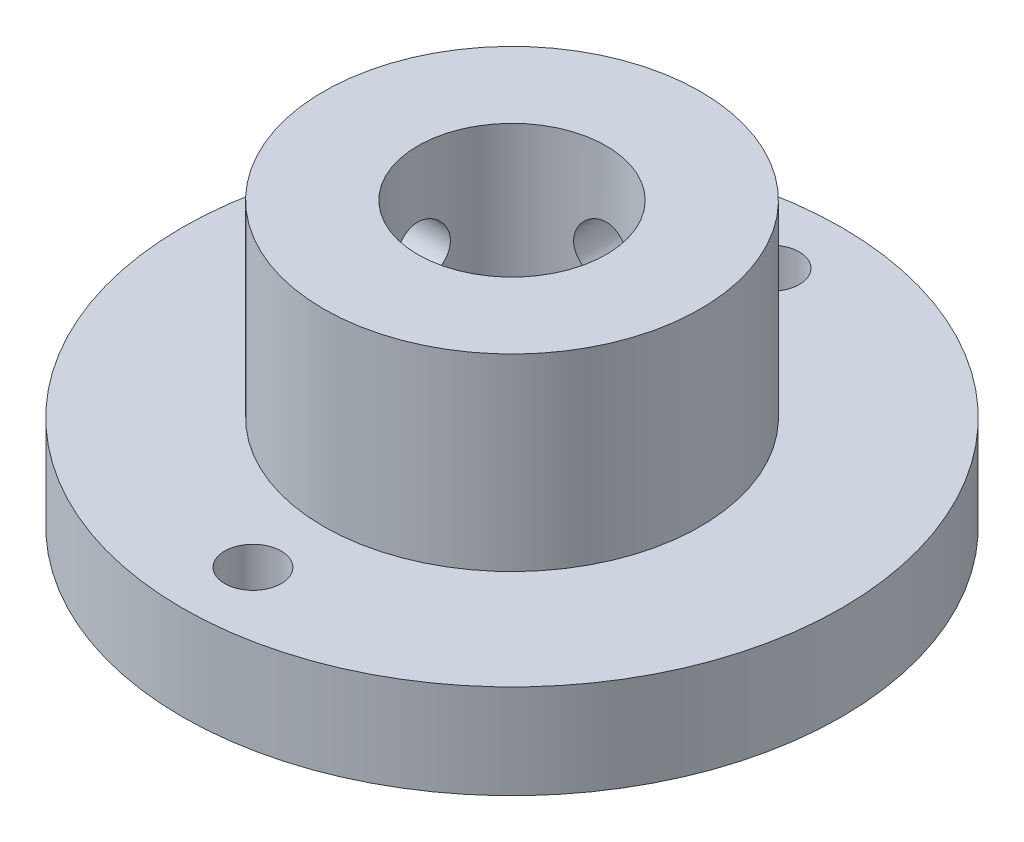
ISO-10303-21;
HEADER;
FILE_DESCRIPTION(('STEP AP214'),'2;1');
FILE_NAME('part.step','',(''),(''),'','','');
FILE_SCHEMA(('AUTOMOTIVE_DESIGN { 1 0 10303 214 1 1 1 1 }'));
ENDSEC;
DATA;
#1=APPLICATION_CONTEXT('core data for automotive mechanical design processes');
#2=APPLICATION_PROTOCOL_DEFINITION('international standard','automotive_design',2000,#1);
#3=PRODUCT_CONTEXT('',#1,'mechanical');
#4=PRODUCT('Part','Part','',(#3));
#5=PRODUCT_RELATED_PRODUCT_CATEGORY('part','',(#4));
#6=PRODUCT_DEFINITION_FORMATION('','',#4);
#7=PRODUCT_DEFINITION_CONTEXT('part definition',#1,'design');
#8=PRODUCT_DEFINITION('design','',#6,#7);
#9=PRODUCT_DEFINITION_SHAPE('','',#8);
#10=(LENGTH_UNIT() NAMED_UNIT(*) SI_UNIT(.MILLI.,.METRE.));
#11=(NAMED_UNIT(*) PLANE_ANGLE_UNIT() SI_UNIT($,.RADIAN.));
#12=(NAMED_UNIT(*) SI_UNIT($,.STERADIAN.) SOLID_ANGLE_UNIT());
#13=UNCERTAINTY_MEASURE_WITH_UNIT(LENGTH_MEASURE(1.E-05),#10,'distance_accuracy_value','');
#14=(GEOMETRIC_REPRESENTATION_CONTEXT(3) GLOBAL_UNCERTAINTY_ASSIGNED_CONTEXT((#13)) GLOBAL_UNIT_ASSIGNED_CONTEXT((#10,
#11,#12)) REPRESENTATION_CONTEXT('',''));
#15=CARTESIAN_POINT('',(0.,0.,0.));
#16=DIRECTION('',(0.,0.,1.));
#17=DIRECTION('',(1.,0.,0.));
#18=AXIS2_PLACEMENT_3D('',#15,#16,#17);
#19=CARTESIAN_POINT('',(0.,5.,0.));
#20=DIRECTION('',(0.,-1.,0.));
#21=DIRECTION('',(0.,0.,-1.));
#22=AXIS2_PLACEMENT_3D('',#19,#20,#21);
#23=CYLINDRICAL_SURFACE('',#22,17.5);
#24=CARTESIAN_POINT('',(0.,5.,0.));
#25=DIRECTION('',(0.,1.,0.));
#26=DIRECTION('',(0.,0.,1.));
#27=AXIS2_PLACEMENT_3D('',#24,#25,#26);
#28=CIRCLE('',#27,17.5);
#29=CARTESIAN_POINT('',(0.,5.,17.5));
#30=VERTEX_POINT('',#29);
#31=EDGE_CURVE('E49',#30,#30,#28,.T.);
#32=ORIENTED_EDGE('',*,*,#31,.F.);
#33=EDGE_LOOP('',(#32));
#34=FACE_BOUND('',#33,.T.);
#35=CARTESIAN_POINT('',(0.,0.,0.));
#36=DIRECTION('',(0.,1.,0.));
#37=DIRECTION('',(0.,0.,1.));
#38=AXIS2_PLACEMENT_3D('',#35,#36,#37);
#39=CIRCLE('',#38,17.5);
#40=CARTESIAN_POINT('',(0.,0.,17.5));
#41=VERTEX_POINT('',#40);
#42=EDGE_CURVE('E54',#41,#41,#39,.T.);
#43=ORIENTED_EDGE('',*,*,#42,.T.);
#44=EDGE_LOOP('',(#43));
#45=FACE_BOUND('',#44,.T.);
#46=ADVANCED_FACE('F37',(#34,#45),#23,.T.);
#47=CARTESIAN_POINT('',(0.,5.,0.));
#48=DIRECTION('',(0.,1.,0.));
#49=DIRECTION('',(0.,0.,1.));
#50=AXIS2_PLACEMENT_3D('',#47,#48,#49);
#51=PLANE('',#50);
#52=CARTESIAN_POINT('',(0.,5.,-13.75));
#53=DIRECTION('',(0.,1.,0.));
#54=DIRECTION('',(0.,0.,1.));
#55=AXIS2_PLACEMENT_3D('',#52,#53,#54);
#56=CIRCLE('',#55,1.5);
#57=CARTESIAN_POINT('',(0.,5.,-12.25));
#58=VERTEX_POINT('',#57);
#59=EDGE_CURVE('E66',#58,#58,#56,.T.);
#60=ORIENTED_EDGE('',*,*,#59,.F.);
#61=EDGE_LOOP('',(#60));
#62=FACE_BOUND('',#61,.T.);
#63=CARTESIAN_POINT('',(0.,5.,13.75));
#64=DIRECTION('',(0.,1.,0.));
#65=DIRECTION('',(0.,0.,1.));
#66=AXIS2_PLACEMENT_3D('',#63,#64,#65);
#67=CIRCLE('',#66,1.5);
#68=CARTESIAN_POINT('',(0.,5.,15.25));
#69=VERTEX_POINT('',#68);
#70=EDGE_CURVE('E98',#69,#69,#67,.T.);
#71=ORIENTED_EDGE('',*,*,#70,.F.);
#72=EDGE_LOOP('',(#71));
#73=FACE_BOUND('',#72,.T.);
#74=CARTESIAN_POINT('',(0.,5.,0.));
#75=DIRECTION('',(0.,1.,0.));
#76=DIRECTION('',(0.,0.,1.));
#77=AXIS2_PLACEMENT_3D('',#74,#75,#76);
#78=CIRCLE('',#77,10.);
#79=CARTESIAN_POINT('',(0.,5.,10.));
#80=VERTEX_POINT('',#79);
#81=EDGE_CURVE('E10',#80,#80,#78,.T.);
#82=ORIENTED_EDGE('',*,*,#81,.F.);
#83=EDGE_LOOP('',(#82));
#84=FACE_BOUND('',#83,.T.);
#85=ORIENTED_EDGE('',*,*,#31,.T.);
#86=EDGE_LOOP('',(#85));
#87=FACE_BOUND('',#86,.T.);
#88=ADVANCED_FACE('F110',(#62,#73,#84,#87),#51,.T.);
#89=CARTESIAN_POINT('',(0.,0.,0.));
#90=DIRECTION('',(0.,1.,0.));
#91=DIRECTION('',(0.,0.,1.));
#92=AXIS2_PLACEMENT_3D('',#89,#90,#91);
#93=PLANE('',#92);
#94=CARTESIAN_POINT('',(0.,0.,-13.75));
#95=DIRECTION('',(0.,1.,0.));
#96=DIRECTION('',(0.,0.,1.));
#97=AXIS2_PLACEMENT_3D('',#94,#95,#96);
#98=CIRCLE('',#97,1.5);
#99=CARTESIAN_POINT('',(0.,0.,-12.25));
#100=VERTEX_POINT('',#99);
#101=EDGE_CURVE('E65',#100,#100,#98,.T.);
#102=ORIENTED_EDGE('',*,*,#101,.T.);
#103=EDGE_LOOP('',(#102));
#104=FACE_BOUND('',#103,.T.);
#105=CARTESIAN_POINT('',(0.,0.,13.75));
#106=DIRECTION('',(0.,1.,0.));
#107=DIRECTION('',(0.,0.,1.));
#108=AXIS2_PLACEMENT_3D('',#105,#106,#107);
#109=CIRCLE('',#108,1.5);
#110=CARTESIAN_POINT('',(0.,0.,15.25));
#111=VERTEX_POINT('',#110);
#112=EDGE_CURVE('E62',#111,#111,#109,.T.);
#113=ORIENTED_EDGE('',*,*,#112,.T.);
#114=EDGE_LOOP('',(#113));
#115=FACE_BOUND('',#114,.T.);
#116=CARTESIAN_POINT('',(0.,0.,0.));
#117=DIRECTION('',(0.,1.,0.));
#118=DIRECTION('',(0.,0.,1.));
#119=AXIS2_PLACEMENT_3D('',#116,#117,#118);
#120=CIRCLE('',#119,5.);
#121=CARTESIAN_POINT('',(0.,0.,5.));
#122=VERTEX_POINT('',#121);
#123=EDGE_CURVE('E202',#122,#122,#120,.T.);
#124=ORIENTED_EDGE('',*,*,#123,.T.);
#125=EDGE_LOOP('',(#124));
#126=FACE_BOUND('',#125,.T.);
#127=ORIENTED_EDGE('',*,*,#42,.F.);
#128=EDGE_LOOP('',(#127));
#129=FACE_BOUND('',#128,.T.);
#130=ADVANCED_FACE('F108',(#104,#115,#126,#129),#93,.F.);
#131=CARTESIAN_POINT('',(0.,15.,0.));
#132=DIRECTION('',(0.,-1.,0.));
#133=DIRECTION('',(0.,0.,-1.));
#134=AXIS2_PLACEMENT_3D('',#131,#132,#133);
#135=CYLINDRICAL_SURFACE('',#134,10.);
#136=CARTESIAN_POINT('',(-10.,8.5,0.));
#137=CARTESIAN_POINT('',(-9.99999865771297,8.50000345381524,-0.083751544481642));
#138=CARTESIAN_POINT('',(-9.9989368253704,8.50703800084064,-0.167551685082131));
#139=CARTESIAN_POINT('',(-9.99480315973187,8.53498319998275,-0.332809627994913));
#140=CARTESIAN_POINT('',(-9.99172936938473,8.5559073629449,-0.414265068974229));
#141=CARTESIAN_POINT('',(-9.98391721219526,8.61099250496762,-0.57241808622186));
#142=CARTESIAN_POINT('',(-9.97918010370919,8.64514347950595,-0.649119207826798));
#143=CARTESIAN_POINT('',(-9.96856475911724,8.72568837941686,-0.795690428635253));
#144=CARTESIAN_POINT('',(-9.96268668152773,8.77208060441736,-0.865561474725188));
#145=CARTESIAN_POINT('',(-9.95039170991452,8.87617726493988,-0.997046719562125));
#146=CARTESIAN_POINT('',(-9.94397133890331,8.93395845620821,-1.0585998322255));
#147=CARTESIAN_POINT('',(-9.93134261133238,9.05902768889387,-1.17117490668948));
#148=CARTESIAN_POINT('',(-9.92513426698505,9.12631627677852,-1.22219626272936));
#149=CARTESIAN_POINT('',(-9.91359877458726,9.26890064352249,-1.31249729499943));
#150=CARTESIAN_POINT('',(-9.90827611975031,9.34423424698134,-1.35171787037205));
#151=CARTESIAN_POINT('',(-9.89916211306268,9.50051282064543,-1.41692632171056));
#152=CARTESIAN_POINT('',(-9.89537067775449,9.58145748474389,-1.44291491889163));
#153=CARTESIAN_POINT('',(-9.88978256218673,9.74601804187172,-1.48073198798911));
#154=CARTESIAN_POINT('',(-9.8879711574125,9.82960939340802,-1.49266503640518));
#155=CARTESIAN_POINT('',(-9.88650348970582,9.99762616598728,-1.50235624033932));
#156=CARTESIAN_POINT('',(-9.88684710303147,10.0820515388625,-1.50011520973796));
#157=CARTESIAN_POINT('',(-9.88963718352409,10.2486010801941,-1.48160733250788));
#158=CARTESIAN_POINT('',(-9.89206618761549,10.3307385264848,-1.4654569592775));
#159=CARTESIAN_POINT('',(-9.89872608126367,10.4911243688715,-1.41977117403734));
#160=CARTESIAN_POINT('',(-9.90295702179379,10.5693726548807,-1.39023538337812));
#161=CARTESIAN_POINT('',(-9.91276335545481,10.7201133712829,-1.31849603529736));
#162=CARTESIAN_POINT('',(-9.91834396766526,10.7925819690924,-1.27624314283198));
#163=CARTESIAN_POINT('',(-9.93021707574548,10.9294445957819,-1.18030413128955));
#164=CARTESIAN_POINT('',(-9.93650961832501,10.9938380942694,-1.12661726182478));
#165=CARTESIAN_POINT('',(-9.94917473056209,11.1133976607397,-1.00869493078248));
#166=CARTESIAN_POINT('',(-9.95554747112815,11.1684649902863,-0.944359329642002));
#167=CARTESIAN_POINT('',(-9.96759647648462,11.2670359345073,-0.807307089894187));
#168=CARTESIAN_POINT('',(-9.9732727382251,11.3105394985439,-0.734590414588171));
#169=CARTESIAN_POINT('',(-9.98329515585393,11.3847530864995,-0.582754598213687));
#170=CARTESIAN_POINT('',(-9.98764051925428,11.4154554918403,-0.503631677836781));
#171=CARTESIAN_POINT('',(-9.99450490557069,11.4631093896854,-0.341273182487062));
#172=CARTESIAN_POINT('',(-9.99702405195467,11.4800618118156,-0.258037885952602));
#173=CARTESIAN_POINT('',(-9.99993581133871,11.4996032298167,-0.0906695676436474));
#174=CARTESIAN_POINT('',(-10.0003485209039,11.5023279713793,-0.00655273187047128));
#175=CARTESIAN_POINT('',(-9.99905561015226,11.493696994689,0.160936677662282));
#176=CARTESIAN_POINT('',(-9.99735005541369,11.4823417123319,0.244309274381876));
#177=CARTESIAN_POINT('',(-9.99202468615333,11.4459858998225,0.407532387431407));
#178=CARTESIAN_POINT('',(-9.98841415207984,11.4210515039692,0.487397963079837));
#179=CARTESIAN_POINT('',(-9.97968235658369,11.3583150025382,0.641814958642998));
#180=CARTESIAN_POINT('',(-9.97456102421565,11.3205122926664,0.716366128795099));
#181=CARTESIAN_POINT('',(-9.96332682468686,11.2327937754361,0.85863497929192));
#182=CARTESIAN_POINT('',(-9.95720701626745,11.1827918599872,0.926299009891564));
#183=CARTESIAN_POINT('',(-9.94467863012165,11.0722141883713,1.0523236731777));
#184=CARTESIAN_POINT('',(-9.93827003562867,11.0116378176754,1.1106837647934));
#185=CARTESIAN_POINT('',(-9.92582264304494,10.8810264668235,1.21693784957195));
#186=CARTESIAN_POINT('',(-9.91978736017588,10.8109170748052,1.26474084747421));
#187=CARTESIAN_POINT('',(-9.90883219104903,10.6635839594882,1.34789129270584));
#188=CARTESIAN_POINT('',(-9.90391227465628,10.5863604284785,1.38323907656436));
#189=CARTESIAN_POINT('',(-9.89577033008645,10.4272624663769,1.44033467323943));
#190=CARTESIAN_POINT('',(-9.89254233006438,10.3454055390288,1.46213037141635));
#191=CARTESIAN_POINT('',(-9.88813382297802,10.1791409845649,1.49165549501586));
#192=CARTESIAN_POINT('',(-9.88695317451771,10.0947335340053,1.49938589183066));
#193=CARTESIAN_POINT('',(-9.88677832610841,9.92667093668422,1.5005378666944));
#194=CARTESIAN_POINT('',(-9.88776226333502,9.84301675824308,1.49410252167313));
#195=CARTESIAN_POINT('',(-9.89175820611174,9.67799473667649,1.46741229544379));
#196=CARTESIAN_POINT('',(-9.89477020841118,9.59662688988661,1.44715743638627));
#197=CARTESIAN_POINT('',(-9.90247526112297,9.43852691776568,1.39345373518665));
#198=CARTESIAN_POINT('',(-9.90716703716075,9.36179132956657,1.36001489324314));
#199=CARTESIAN_POINT('',(-9.91770454557702,9.2149963661976,1.28090667642309));
#200=CARTESIAN_POINT('',(-9.92355031702724,9.14493721719636,1.23523688741502));
#201=CARTESIAN_POINT('',(-9.93580743364938,9.01275694202483,1.13244337659164));
#202=CARTESIAN_POINT('',(-9.94222367881967,8.95071866675294,1.07521369039806));
#203=CARTESIAN_POINT('',(-9.95485788826636,8.83707544521218,0.951148841082835));
#204=CARTESIAN_POINT('',(-9.96107580610759,8.78547292742384,0.884311448350942));
#205=CARTESIAN_POINT('',(-9.9726518579052,8.69391232339264,0.742495707543723));
#206=CARTESIAN_POINT('',(-9.9780050712882,8.65401989078526,0.667474576764761));
#207=CARTESIAN_POINT('',(-9.98720028802959,8.58746148324196,0.51175187024872));
#208=CARTESIAN_POINT('',(-9.99104385565757,8.56078180994631,0.431056277096705));
#209=CARTESIAN_POINT('',(-9.99590939261505,8.52745865728989,0.29166572788933));
#210=CARTESIAN_POINT('',(-9.99743549179557,8.51717739846119,0.233831133495279));
#211=CARTESIAN_POINT('',(-9.99948125947896,8.50344690228736,0.117338971600125));
#212=CARTESIAN_POINT('',(-10.0000009404877,8.49999758004746,0.0586814143344171));
#213=CARTESIAN_POINT('',(-10.,8.5,0.));
#214=B_SPLINE_CURVE_WITH_KNOTS('',3,(#136,#137,#138,#139,#140,#141,#142,#143,#144,#145,#146,
#147,#148,#149,#150,#151,#152,#153,#154,#155,#156,#157,#158,#159,#160,#161,#162,#163,#164,#165,
#166,#167,#168,#169,#170,#171,#172,#173,#174,#175,#176,#177,#178,#179,#180,#181,#182,#183,#184,
#185,#186,#187,#188,#189,#190,#191,#192,#193,#194,#195,#196,#197,#198,#199,#200,#201,#202,#203,
#204,#205,#206,#207,#208,#209,#210,#211,#212,#213),.UNSPECIFIED.,.T.,.F.,(4,2,2,2,2,2,2,2,2,2,2,
2,2,2,2,2,2,2,2,2,2,2,2,2,2,2,2,2,2,2,2,2,2,2,2,2,2,2,4),(0.,0.251040205031663,0.50232496292915,
0.753420023583236,1.0044802241976,1.25729416136843,1.5101226357258,1.76419702395375,
2.01825756225506,2.27041564605924,2.52255925098982,2.77261177195746,3.02267136690361,
3.27371383476159,3.52477278308534,3.77834291255408,4.03191415238668,4.28563608984874,
4.53934087193401,4.79062058544255,5.04189251991155,5.29195148965948,5.54202220376273,
5.79391188036907,6.04581620028629,6.29981366584671,6.55380426808832,6.80689223457167,
7.05996272137176,7.31048888261064,7.56101464229563,7.81135073984146,8.06169531466879,
8.3144482996572,8.56726003468733,8.82146323384733,9.07540233261441,9.25129851978808,
9.42719252123291),.UNSPECIFIED.);
#215=CARTESIAN_POINT('',(-10.,8.5,0.));
#216=VERTEX_POINT('',#215);
#217=EDGE_CURVE('E76',#216,#216,#214,.T.);
#218=ORIENTED_EDGE('',*,*,#217,.T.);
#219=EDGE_LOOP('',(#218));
#220=FACE_BOUND('',#219,.T.);
#221=CARTESIAN_POINT('',(0.,11.5,-10.));
#222=CARTESIAN_POINT('',(-0.0837515444816421,11.4999965461848,-9.99999865771297));
#223=CARTESIAN_POINT('',(-0.167551685082132,11.4929619991594,-9.9989368253704));
#224=CARTESIAN_POINT('',(-0.332809627994913,11.4650168000173,-9.99480315973187));
#225=CARTESIAN_POINT('',(-0.414265068974229,11.4440926370551,-9.99172936938473));
#226=CARTESIAN_POINT('',(-0.57241808622186,11.3890074950324,-9.98391721219526));
#227=CARTESIAN_POINT('',(-0.649119207826798,11.3548565204941,-9.97918010370919));
#228=CARTESIAN_POINT('',(-0.795690428635253,11.2743116205831,-9.96856475911724));
#229=CARTESIAN_POINT('',(-0.865561474725188,11.2279193955826,-9.96268668152773));
#230=CARTESIAN_POINT('',(-0.997046719562125,11.1238227350601,-9.95039170991452));
#231=CARTESIAN_POINT('',(-1.0585998322255,11.0660415437918,-9.94397133890331));
#232=CARTESIAN_POINT('',(-1.17117490668948,10.9409723111061,-9.93134261133238));
#233=CARTESIAN_POINT('',(-1.22219626272936,10.8736837232215,-9.92513426698505));
#234=CARTESIAN_POINT('',(-1.31249729499943,10.7310993564775,-9.91359877458726));
#235=CARTESIAN_POINT('',(-1.35171787037205,10.6557657530187,-9.90827611975031));
#236=CARTESIAN_POINT('',(-1.41692632171056,10.4994871793546,-9.89916211306268));
#237=CARTESIAN_POINT('',(-1.44291491889163,10.4185425152561,-9.89537067775449));
#238=CARTESIAN_POINT('',(-1.48073198798911,10.2539819581283,-9.88978256218673));
#239=CARTESIAN_POINT('',(-1.49266503640518,10.170390606592,-9.8879711574125));
#240=CARTESIAN_POINT('',(-1.50235624033932,10.0023738340127,-9.88650348970582));
#241=CARTESIAN_POINT('',(-1.50011520973796,9.91794846113751,-9.88684710303147));
#242=CARTESIAN_POINT('',(-1.48160733250788,9.75139891980586,-9.88963718352409));
#243=CARTESIAN_POINT('',(-1.4654569592775,9.6692614735152,-9.89206618761549));
#244=CARTESIAN_POINT('',(-1.41977117403734,9.50887563112847,-9.89872608126367));
#245=CARTESIAN_POINT('',(-1.39023538337812,9.43062734511926,-9.90295702179379));
#246=CARTESIAN_POINT('',(-1.31849603529736,9.27988662871715,-9.91276335545481));
#247=CARTESIAN_POINT('',(-1.27624314283198,9.20741803090761,-9.91834396766526));
#248=CARTESIAN_POINT('',(-1.18030413128955,9.07055540421807,-9.93021707574548));
#249=CARTESIAN_POINT('',(-1.12661726182478,9.00616190573063,-9.93650961832501));
#250=CARTESIAN_POINT('',(-1.00869493078248,8.88660233926029,-9.94917473056209));
#251=CARTESIAN_POINT('',(-0.944359329642002,8.83153500971366,-9.95554747112815));
#252=CARTESIAN_POINT('',(-0.807307089894187,8.73296406549274,-9.96759647648462));
#253=CARTESIAN_POINT('',(-0.73459041458817,8.68946050145611,-9.9732727382251));
#254=CARTESIAN_POINT('',(-0.582754598213687,8.61524691350046,-9.98329515585393));
#255=CARTESIAN_POINT('',(-0.503631677836781,8.58454450815971,-9.98764051925428));
#256=CARTESIAN_POINT('',(-0.341273182487062,8.53689061031463,-9.99450490557069));
#257=CARTESIAN_POINT('',(-0.258037885952602,8.51993818818443,-9.99702405195467));
#258=CARTESIAN_POINT('',(-0.0906695676436471,8.50039677018331,-9.99993581133871));
#259=CARTESIAN_POINT('',(-0.00655273187047109,8.49767202862068,-10.0003485209039));
#260=CARTESIAN_POINT('',(0.160936677662282,8.50630300531103,-9.99905561015226));
#261=CARTESIAN_POINT('',(0.244309274381876,8.5176582876681,-9.99735005541368));
#262=CARTESIAN_POINT('',(0.407532387431407,8.55401410017754,-9.99202468615333));
#263=CARTESIAN_POINT('',(0.487397963079837,8.57894849603085,-9.98841415207984));
#264=CARTESIAN_POINT('',(0.641814958642999,8.64168499746176,-9.97968235658369));
#265=CARTESIAN_POINT('',(0.716366128795099,8.67948770733363,-9.97456102421565));
#266=CARTESIAN_POINT('',(0.85863497929192,8.76720622456386,-9.96332682468686));
#267=CARTESIAN_POINT('',(0.926299009891565,8.81720814001278,-9.95720701626745));
#268=CARTESIAN_POINT('',(1.05232367317771,8.92778581162875,-9.94467863012165));
#269=CARTESIAN_POINT('',(1.1106837647934,8.98836218232465,-9.93827003562867));
#270=CARTESIAN_POINT('',(1.21693784957195,9.11897353317649,-9.92582264304494));
#271=CARTESIAN_POINT('',(1.26474084747421,9.18908292519477,-9.91978736017588));
#272=CARTESIAN_POINT('',(1.34789129270584,9.33641604051177,-9.90883219104903));
#273=CARTESIAN_POINT('',(1.38323907656436,9.41363957152147,-9.90391227465628));
#274=CARTESIAN_POINT('',(1.44033467323943,9.57273753362313,-9.89577033008645));
#275=CARTESIAN_POINT('',(1.46213037141635,9.65459446097125,-9.89254233006438));
#276=CARTESIAN_POINT('',(1.49165549501586,9.82085901543511,-9.88813382297802));
#277=CARTESIAN_POINT('',(1.49938589183066,9.90526646599468,-9.88695317451771));
#278=CARTESIAN_POINT('',(1.5005378666944,10.0733290633158,-9.88677832610841));
#279=CARTESIAN_POINT('',(1.49410252167313,10.1569832417569,-9.88776226333502));
#280=CARTESIAN_POINT('',(1.46741229544379,10.3220052633235,-9.89175820611174));
#281=CARTESIAN_POINT('',(1.44715743638627,10.4033731101134,-9.89477020841118));
#282=CARTESIAN_POINT('',(1.39345373518665,10.5614730822343,-9.90247526112297));
#283=CARTESIAN_POINT('',(1.36001489324314,10.6382086704334,-9.90716703716075));
#284=CARTESIAN_POINT('',(1.28090667642309,10.7850036338024,-9.91770454557702));
#285=CARTESIAN_POINT('',(1.23523688741502,10.8550627828036,-9.92355031702724));
#286=CARTESIAN_POINT('',(1.13244337659164,10.9872430579752,-9.93580743364938));
#287=CARTESIAN_POINT('',(1.07521369039806,11.0492813332471,-9.94222367881967));
#288=CARTESIAN_POINT('',(0.951148841082836,11.1629245547878,-9.95485788826636));
#289=CARTESIAN_POINT('',(0.884311448350942,11.2145270725762,-9.96107580610759));
#290=CARTESIAN_POINT('',(0.742495707543722,11.3060876766074,-9.9726518579052));
#291=CARTESIAN_POINT('',(0.66747457676476,11.3459801092147,-9.9780050712882));
#292=CARTESIAN_POINT('',(0.511751870248719,11.412538516758,-9.98720028802959));
#293=CARTESIAN_POINT('',(0.431056277096705,11.4392181900537,-9.99104385565757));
#294=CARTESIAN_POINT('',(0.29166572788933,11.4725413427101,-9.99590939261505));
#295=CARTESIAN_POINT('',(0.233831133495279,11.4828226015388,-9.99743549179557));
#296=CARTESIAN_POINT('',(0.117338971600125,11.4965530977126,-9.99948125947896));
#297=CARTESIAN_POINT('',(0.0586814143344172,11.5000024199525,-10.0000009404877));
#298=CARTESIAN_POINT('',(0.,11.5,-10.));
#299=B_SPLINE_CURVE_WITH_KNOTS('',3,(#221,#222,#223,#224,#225,#226,#227,#228,#229,#230,#231,
#232,#233,#234,#235,#236,#237,#238,#239,#240,#241,#242,#243,#244,#245,#246,#247,#248,#249,#250,
#251,#252,#253,#254,#255,#256,#257,#258,#259,#260,#261,#262,#263,#264,#265,#266,#267,#268,#269,
#270,#271,#272,#273,#274,#275,#276,#277,#278,#279,#280,#281,#282,#283,#284,#285,#286,#287,#288,
#289,#290,#291,#292,#293,#294,#295,#296,#297,#298),.UNSPECIFIED.,.T.,.F.,(4,2,2,2,2,2,2,2,2,2,2,
2,2,2,2,2,2,2,2,2,2,2,2,2,2,2,2,2,2,2,2,2,2,2,2,2,2,2,4),(0.,0.251040205031663,0.50232496292915,
0.753420023583236,1.0044802241976,1.25729416136843,1.5101226357258,1.76419702395375,
2.01825756225506,2.27041564605924,2.52255925098982,2.77261177195746,3.02267136690361,
3.27371383476159,3.52477278308534,3.77834291255409,4.03191415238668,4.28563608984874,
4.53934087193401,4.79062058544255,5.04189251991155,5.29195148965948,5.54202220376273,
5.79391188036907,6.04581620028629,6.29981366584672,6.55380426808832,6.80689223457168,
7.05996272137176,7.31048888261064,7.56101464229564,7.81135073984146,8.06169531466879,
8.3144482996572,8.56726003468733,8.82146323384733,9.07540233261441,9.25129851978808,
9.42719252123291),.UNSPECIFIED.);
#300=CARTESIAN_POINT('',(0.,11.5,-10.));
#301=VERTEX_POINT('',#300);
#302=EDGE_CURVE('E75',#301,#301,#299,.T.);
#303=ORIENTED_EDGE('',*,*,#302,.T.);
#304=EDGE_LOOP('',(#303));
#305=FACE_BOUND('',#304,.T.);
#306=CARTESIAN_POINT('',(0.,15.,0.));
#307=DIRECTION('',(0.,1.,0.));
#308=DIRECTION('',(0.,0.,1.));
#309=AXIS2_PLACEMENT_3D('',#306,#307,#308);
#310=CIRCLE('',#309,10.);
#311=CARTESIAN_POINT('',(0.,15.,10.));
#312=VERTEX_POINT('',#311);
#313=EDGE_CURVE('E57',#312,#312,#310,.T.);
#314=ORIENTED_EDGE('',*,*,#313,.F.);
#315=EDGE_LOOP('',(#314));
#316=FACE_BOUND('',#315,.T.);
#317=ORIENTED_EDGE('',*,*,#81,.T.);
#318=EDGE_LOOP('',(#317));
#319=FACE_BOUND('',#318,.T.);
#320=ADVANCED_FACE('F103',(#220,#305,#316,#319),#135,.T.);
#321=CARTESIAN_POINT('',(0.,15.,0.));
#322=DIRECTION('',(0.,1.,0.));
#323=DIRECTION('',(0.,0.,1.));
#324=AXIS2_PLACEMENT_3D('',#321,#322,#323);
#325=PLANE('',#324);
#326=CARTESIAN_POINT('',(0.,15.,0.));
#327=DIRECTION('',(0.,1.,0.));
#328=DIRECTION('',(0.,0.,1.));
#329=AXIS2_PLACEMENT_3D('',#326,#327,#328);
#330=CIRCLE('',#329,5.);
#331=CARTESIAN_POINT('',(0.,15.,5.));
#332=VERTEX_POINT('',#331);
#333=EDGE_CURVE('E68',#332,#332,#330,.T.);
#334=ORIENTED_EDGE('',*,*,#333,.F.);
#335=EDGE_LOOP('',(#334));
#336=FACE_BOUND('',#335,.T.);
#337=ORIENTED_EDGE('',*,*,#313,.T.);
#338=EDGE_LOOP('',(#337));
#339=FACE_BOUND('',#338,.T.);
#340=ADVANCED_FACE('F107',(#336,#339),#325,.T.);
#341=CARTESIAN_POINT('',(0.,0.,0.));
#342=DIRECTION('',(0.,1.,0.));
#343=DIRECTION('',(0.,0.,1.));
#344=AXIS2_PLACEMENT_3D('',#341,#342,#343);
#345=CYLINDRICAL_SURFACE('',#344,5.);
#346=CARTESIAN_POINT('',(-4.76969600708473,10.,-1.5));
#347=CARTESIAN_POINT('',(-4.7696968572698,9.9178054520576,-1.49999897633764));
#348=CARTESIAN_POINT('',(-4.77184390209069,9.83560077585598,-1.49322108167142));
#349=CARTESIAN_POINT('',(-4.780165783029,9.67359475040806,-1.46635844446749));
#350=CARTESIAN_POINT('',(-4.78634196493468,9.59379421349854,-1.44626925573578));
#351=CARTESIAN_POINT('',(-4.80196102485632,9.43896527172827,-1.39352753269955));
#352=CARTESIAN_POINT('',(-4.81139846703232,9.36392917036692,-1.36089589394243));
#353=CARTESIAN_POINT('',(-4.83246932547567,9.2203780660047,-1.28406421917929));
#354=CARTESIAN_POINT('',(-4.84410307041019,9.15186404131556,-1.23986245137053));
#355=CARTESIAN_POINT('',(-4.86866862185765,9.02113360942263,-1.13964754141627));
#356=CARTESIAN_POINT('',(-4.88162808311636,8.95915410205372,-1.08333207175807));
#357=CARTESIAN_POINT('',(-4.90714861936757,8.84536204867749,-0.961136237579599));
#358=CARTESIAN_POINT('',(-4.91970964297705,8.79355080955012,-0.895254645461112));
#359=CARTESIAN_POINT('',(-4.94333214579389,8.7005373001667,-0.754111437793691));
#360=CARTESIAN_POINT('',(-4.95435724342404,8.65957657555719,-0.678684021335815));
#361=CARTESIAN_POINT('',(-4.97334435920684,8.59101274095725,-0.521624645369354));
#362=CARTESIAN_POINT('',(-4.98130703789495,8.56340675014255,-0.439994028387912));
#363=CARTESIAN_POINT('',(-4.99307646003589,8.5231199989095,-0.27532385263083));
#364=CARTESIAN_POINT('',(-4.99699557369338,8.5100348723473,-0.192391398953802));
#365=CARTESIAN_POINT('',(-5.00063201501348,8.49788267535356,-0.0254218237493157));
#366=CARTESIAN_POINT('',(-5.00035022521079,8.49881266059804,0.0586150620503674));
#367=CARTESIAN_POINT('',(-4.99569603817659,8.51439286854303,0.222571156600159));
#368=CARTESIAN_POINT('',(-4.9914542020526,8.52860519380987,0.30253626764134));
#369=CARTESIAN_POINT('',(-4.97951522112593,8.56963133599429,0.458889213442526));
#370=CARTESIAN_POINT('',(-4.97181785750586,8.59644595094267,0.535276821322845));
#371=CARTESIAN_POINT('',(-4.95365220986963,8.66221202341856,0.68334732635128));
#372=CARTESIAN_POINT('',(-4.94315269676706,8.70130120280727,0.754965064694477));
#373=CARTESIAN_POINT('',(-4.92049640648069,8.79039785242823,0.890764673783155));
#374=CARTESIAN_POINT('',(-4.90833923637778,8.84040791296349,0.95494477487213));
#375=CARTESIAN_POINT('',(-4.88311550488166,8.9521977507516,1.0766604815298));
#376=CARTESIAN_POINT('',(-4.87003195321461,9.01435691902974,1.13384458040111));
#377=CARTESIAN_POINT('',(-4.84483979887497,9.14751001789005,1.23707651539823));
#378=CARTESIAN_POINT('',(-4.8327312931702,9.21850482538923,1.28312324482852));
#379=CARTESIAN_POINT('',(-4.81077903197678,9.36823946924899,1.3631399533545));
#380=CARTESIAN_POINT('',(-4.80095810695957,9.44704704586292,1.39698989237679));
#381=CARTESIAN_POINT('',(-4.78496392548436,9.60960720844554,1.45083362878413));
#382=CARTESIAN_POINT('',(-4.7787894791583,9.69335817153456,1.4708319464056));
#383=CARTESIAN_POINT('',(-4.77104849541241,9.86008236073928,1.49574770282165));
#384=CARTESIAN_POINT('',(-4.76931878670441,9.94296822389398,1.50119946380212));
#385=CARTESIAN_POINT('',(-4.77021192441924,10.1084729000099,1.49835947233062));
#386=CARTESIAN_POINT('',(-4.77283416156589,10.1910917487308,1.4900696437133));
#387=CARTESIAN_POINT('',(-4.78197558554912,10.3514883779709,1.4604576357419));
#388=CARTESIAN_POINT('',(-4.78839176507489,10.4293361642635,1.4394796143128));
#389=CARTESIAN_POINT('',(-4.80429141231227,10.5804016908149,1.3854857774794));
#390=CARTESIAN_POINT('',(-4.81377535359073,10.6536187141406,1.3524681034276));
#391=CARTESIAN_POINT('',(-4.83505835023047,10.7955174640721,1.274318711965));
#392=CARTESIAN_POINT('',(-4.84691271069798,10.8640247209858,1.22888564172729));
#393=CARTESIAN_POINT('',(-4.87148205646987,10.9926381061808,1.12755301600385));
#394=CARTESIAN_POINT('',(-4.88419724730003,11.0527422176128,1.07165095534897));
#395=CARTESIAN_POINT('',(-4.90963633548158,11.1651804058147,0.948455132493599));
#396=CARTESIAN_POINT('',(-4.92234245063004,11.217135628987,0.880811065857434));
#397=CARTESIAN_POINT('',(-4.94584851748651,11.3089667010278,0.73746178459025));
#398=CARTESIAN_POINT('',(-4.95664856384717,11.3488431497815,0.661756970543945));
#399=CARTESIAN_POINT('',(-4.97505970474957,11.4150000305683,0.504935504705224));
#400=CARTESIAN_POINT('',(-4.98269453424966,11.441382016159,0.423864622037841));
#401=CARTESIAN_POINT('',(-4.99401979596827,11.4800609188904,0.25816996650459));
#402=CARTESIAN_POINT('',(-4.9977113567088,11.4923618659484,0.173547217354765));
#403=CARTESIAN_POINT('',(-5.00066544081399,11.5022230440545,0.00665215388274478));
#404=CARTESIAN_POINT('',(-5.00009305111322,11.5003326954078,-0.0755851790862046));
#405=CARTESIAN_POINT('',(-4.99497264465037,11.4831783675009,-0.238519481164402));
#406=CARTESIAN_POINT('',(-4.99042485330462,11.4679151465196,-0.319216537346527));
#407=CARTESIAN_POINT('',(-4.97791168358327,11.4247883386004,-0.475935813041356));
#408=CARTESIAN_POINT('',(-4.96998352900866,11.397061819351,-0.55199892735139));
#409=CARTESIAN_POINT('',(-4.9515294303945,11.3299180854928,-0.698433237752051));
#410=CARTESIAN_POINT('',(-4.94100305949946,11.2904989497138,-0.768803496050578));
#411=CARTESIAN_POINT('',(-4.91803965828228,11.19962654257,-0.904301892420561));
#412=CARTESIAN_POINT('',(-4.90555226923559,11.1478285699992,-0.969190250076764));
#413=CARTESIAN_POINT('',(-4.88023537212334,11.0342896116672,-1.08953757134594));
#414=CARTESIAN_POINT('',(-4.86740576641079,10.9725457621019,-1.14499380960193));
#415=CARTESIAN_POINT('',(-4.84240680631319,10.8386592216895,-1.24656269394549));
#416=CARTESIAN_POINT('',(-4.83026852693485,10.7662614466096,-1.29234759757956));
#417=CARTESIAN_POINT('',(-4.80852547508793,10.614444825839,-1.37104313528775));
#418=CARTESIAN_POINT('',(-4.79891948596956,10.5350293763988,-1.40395995557288));
#419=CARTESIAN_POINT('',(-4.78427816717594,10.3802595683937,-1.4530194253295));
#420=CARTESIAN_POINT('',(-4.7788615484052,10.305391353069,-1.47058859011232));
#421=CARTESIAN_POINT('',(-4.77157042597167,10.1536847775042,-1.49407818835144));
#422=CARTESIAN_POINT('',(-4.7696952122143,10.0768468153548,-1.50000095706095));
#423=CARTESIAN_POINT('',(-4.76969600708473,10.,-1.5));
#424=B_SPLINE_CURVE_WITH_KNOTS('',3,(#346,#347,#348,#349,#350,#351,#352,#353,#354,#355,#356,
#357,#358,#359,#360,#361,#362,#363,#364,#365,#366,#367,#368,#369,#370,#371,#372,#373,#374,#375,
#376,#377,#378,#379,#380,#381,#382,#383,#384,#385,#386,#387,#388,#389,#390,#391,#392,#393,#394,
#395,#396,#397,#398,#399,#400,#401,#402,#403,#404,#405,#406,#407,#408,#409,#410,#411,#412,#413,
#414,#415,#416,#417,#418,#419,#420,#421,#422,#423),.UNSPECIFIED.,.T.,.F.,(4,2,2,2,2,2,2,2,2,2,2,
2,2,2,2,2,2,2,2,2,2,2,2,2,2,2,2,2,2,2,2,2,2,2,2,2,2,2,4),(0.,0.246300165915544,
0.492682641688999,0.738656414466193,0.9846670253701,1.23773150007984,1.49082847871273,
1.74915939273644,2.00743455587877,2.25832140149558,2.5091555410144,2.7520012599088,
2.99486235890376,3.24055209335676,3.4863001659083,3.74152147023278,3.99676812491863,
4.25446238246266,4.51207250628411,4.76008080790309,5.00805439107387,5.24958594938817,
5.49115481045787,5.73920731809388,5.98731925928923,6.24479506100602,6.50225807324202,
6.75775391814325,7.01317662321682,7.2587630391122,7.50433553047754,7.74727096872219,
7.99024634491378,8.24099627054488,8.4918185262989,8.75011639669147,9.00828993963944,
9.23861153857448,9.4688869503356),.UNSPECIFIED.);
#425=CARTESIAN_POINT('',(-4.76969600708473,10.,-1.5));
#426=VERTEX_POINT('',#425);
#427=EDGE_CURVE('E40',#426,#426,#424,.T.);
#428=ORIENTED_EDGE('',*,*,#427,.T.);
#429=EDGE_LOOP('',(#428));
#430=FACE_BOUND('',#429,.T.);
#431=CARTESIAN_POINT('',(1.5,10.,-4.76969600708473));
#432=CARTESIAN_POINT('',(1.49999897633764,9.9178054520576,-4.7696968572698));
#433=CARTESIAN_POINT('',(1.49322108167142,9.83560077585598,-4.77184390209069));
#434=CARTESIAN_POINT('',(1.46635844446749,9.67359475040806,-4.780165783029));
#435=CARTESIAN_POINT('',(1.44626925573578,9.59379421349854,-4.78634196493468));
#436=CARTESIAN_POINT('',(1.39352753269955,9.43896527172827,-4.80196102485632));
#437=CARTESIAN_POINT('',(1.36089589394243,9.36392917036692,-4.81139846703232));
#438=CARTESIAN_POINT('',(1.28406421917929,9.2203780660047,-4.83246932547567));
#439=CARTESIAN_POINT('',(1.23986245137053,9.15186404131557,-4.84410307041019));
#440=CARTESIAN_POINT('',(1.13964754141627,9.02113360942263,-4.86866862185765));
#441=CARTESIAN_POINT('',(1.08333207175807,8.95915410205372,-4.88162808311636));
#442=CARTESIAN_POINT('',(0.9611362375796,8.8453620486775,-4.90714861936757));
#443=CARTESIAN_POINT('',(0.895254645461113,8.79355080955013,-4.91970964297705));
#444=CARTESIAN_POINT('',(0.754111437793691,8.7005373001667,-4.94333214579389));
#445=CARTESIAN_POINT('',(0.678684021335815,8.6595765755572,-4.95435724342404));
#446=CARTESIAN_POINT('',(0.521624645369354,8.59101274095725,-4.97334435920684));
#447=CARTESIAN_POINT('',(0.439994028387912,8.56340675014256,-4.98130703789495));
#448=CARTESIAN_POINT('',(0.27532385263083,8.5231199989095,-4.99307646003589));
#449=CARTESIAN_POINT('',(0.192391398953802,8.5100348723473,-4.99699557369338));
#450=CARTESIAN_POINT('',(0.0254218237493157,8.49788267535356,-5.00063201501348));
#451=CARTESIAN_POINT('',(-0.0586150620503674,8.49881266059804,-5.00035022521079));
#452=CARTESIAN_POINT('',(-0.222571156600159,8.51439286854303,-4.99569603817659));
#453=CARTESIAN_POINT('',(-0.30253626764134,8.52860519380987,-4.9914542020526));
#454=CARTESIAN_POINT('',(-0.458889213442526,8.56963133599429,-4.97951522112593));
#455=CARTESIAN_POINT('',(-0.535276821322845,8.59644595094267,-4.97181785750586));
#456=CARTESIAN_POINT('',(-0.683347326351279,8.66221202341856,-4.95365220986963));
#457=CARTESIAN_POINT('',(-0.754965064694476,8.70130120280727,-4.94315269676706));
#458=CARTESIAN_POINT('',(-0.890764673783154,8.79039785242823,-4.92049640648069));
#459=CARTESIAN_POINT('',(-0.95494477487213,8.84040791296349,-4.90833923637778));
#460=CARTESIAN_POINT('',(-1.0766604815298,8.9521977507516,-4.88311550488165));
#461=CARTESIAN_POINT('',(-1.13384458040111,9.01435691902974,-4.87003195321461));
#462=CARTESIAN_POINT('',(-1.23707651539823,9.14751001789005,-4.84483979887497));
#463=CARTESIAN_POINT('',(-1.28312324482852,9.21850482538923,-4.8327312931702));
#464=CARTESIAN_POINT('',(-1.3631399533545,9.36823946924899,-4.81077903197678));
#465=CARTESIAN_POINT('',(-1.39698989237679,9.44704704586292,-4.80095810695957));
#466=CARTESIAN_POINT('',(-1.45083362878413,9.60960720844554,-4.78496392548436));
#467=CARTESIAN_POINT('',(-1.4708319464056,9.69335817153456,-4.7787894791583));
#468=CARTESIAN_POINT('',(-1.49574770282165,9.86008236073928,-4.77104849541241));
#469=CARTESIAN_POINT('',(-1.50119946380212,9.94296822389398,-4.76931878670441));
#470=CARTESIAN_POINT('',(-1.49835947233062,10.1084729000099,-4.77021192441924));
#471=CARTESIAN_POINT('',(-1.4900696437133,10.1910917487308,-4.77283416156589));
#472=CARTESIAN_POINT('',(-1.4604576357419,10.3514883779709,-4.78197558554912));
#473=CARTESIAN_POINT('',(-1.4394796143128,10.4293361642635,-4.78839176507489));
#474=CARTESIAN_POINT('',(-1.3854857774794,10.5804016908149,-4.80429141231227));
#475=CARTESIAN_POINT('',(-1.3524681034276,10.6536187141406,-4.81377535359073));
#476=CARTESIAN_POINT('',(-1.274318711965,10.7955174640721,-4.83505835023047));
#477=CARTESIAN_POINT('',(-1.22888564172729,10.8640247209858,-4.84691271069798));
#478=CARTESIAN_POINT('',(-1.12755301600385,10.9926381061808,-4.87148205646987));
#479=CARTESIAN_POINT('',(-1.07165095534897,11.0527422176128,-4.88419724730003));
#480=CARTESIAN_POINT('',(-0.948455132493599,11.1651804058147,-4.90963633548158));
#481=CARTESIAN_POINT('',(-0.880811065857435,11.217135628987,-4.92234245063004));
#482=CARTESIAN_POINT('',(-0.73746178459025,11.3089667010278,-4.94584851748651));
#483=CARTESIAN_POINT('',(-0.661756970543945,11.3488431497815,-4.95664856384717));
#484=CARTESIAN_POINT('',(-0.504935504705223,11.4150000305683,-4.97505970474957));
#485=CARTESIAN_POINT('',(-0.423864622037841,11.441382016159,-4.98269453424966));
#486=CARTESIAN_POINT('',(-0.25816996650459,11.4800609188904,-4.99401979596827));
#487=CARTESIAN_POINT('',(-0.173547217354765,11.4923618659484,-4.9977113567088));
#488=CARTESIAN_POINT('',(-0.00665215388274471,11.5022230440545,-5.00066544081399));
#489=CARTESIAN_POINT('',(0.0755851790862048,11.5003326954078,-5.00009305111322));
#490=CARTESIAN_POINT('',(0.238519481164402,11.4831783675009,-4.99497264465037));
#491=CARTESIAN_POINT('',(0.319216537346527,11.4679151465196,-4.99042485330462));
#492=CARTESIAN_POINT('',(0.475935813041356,11.4247883386004,-4.97791168358327));
#493=CARTESIAN_POINT('',(0.55199892735139,11.397061819351,-4.96998352900866));
#494=CARTESIAN_POINT('',(0.698433237752051,11.3299180854928,-4.9515294303945));
#495=CARTESIAN_POINT('',(0.768803496050578,11.2904989497138,-4.94100305949946));
#496=CARTESIAN_POINT('',(0.904301892420561,11.19962654257,-4.91803965828228));
#497=CARTESIAN_POINT('',(0.969190250076764,11.1478285699992,-4.90555226923559));
#498=CARTESIAN_POINT('',(1.08953757134594,11.0342896116672,-4.88023537212334));
#499=CARTESIAN_POINT('',(1.14499380960193,10.9725457621019,-4.86740576641079));
#500=CARTESIAN_POINT('',(1.24656269394549,10.8386592216895,-4.84240680631319));
#501=CARTESIAN_POINT('',(1.29234759757956,10.7662614466096,-4.83026852693485));
#502=CARTESIAN_POINT('',(1.37104313528776,10.614444825839,-4.80852547508793));
#503=CARTESIAN_POINT('',(1.40395995557288,10.5350293763988,-4.79891948596956));
#504=CARTESIAN_POINT('',(1.45301942532949,10.3802595683937,-4.78427816717595));
#505=CARTESIAN_POINT('',(1.47058859011232,10.305391353069,-4.7788615484052));
#506=CARTESIAN_POINT('',(1.49407818835144,10.1536847775042,-4.77157042597167));
#507=CARTESIAN_POINT('',(1.50000095706095,10.0768468153548,-4.7696952122143));
#508=CARTESIAN_POINT('',(1.5,10.,-4.76969600708473));
#509=B_SPLINE_CURVE_WITH_KNOTS('',3,(#431,#432,#433,#434,#435,#436,#437,#438,#439,#440,#441,
#442,#443,#444,#445,#446,#447,#448,#449,#450,#451,#452,#453,#454,#455,#456,#457,#458,#459,#460,
#461,#462,#463,#464,#465,#466,#467,#468,#469,#470,#471,#472,#473,#474,#475,#476,#477,#478,#479,
#480,#481,#482,#483,#484,#485,#486,#487,#488,#489,#490,#491,#492,#493,#494,#495,#496,#497,#498,
#499,#500,#501,#502,#503,#504,#505,#506,#507,#508),.UNSPECIFIED.,.T.,.F.,(4,2,2,2,2,2,2,2,2,2,2,
2,2,2,2,2,2,2,2,2,2,2,2,2,2,2,2,2,2,2,2,2,2,2,2,2,2,2,4),(0.,0.24630016591554,0.492682641688999,
0.738656414466193,0.9846670253701,1.23773150007984,1.49082847871273,1.74915939273644,
2.00743455587877,2.25832140149558,2.5091555410144,2.7520012599088,2.99486235890376,
3.24055209335676,3.4863001659083,3.74152147023278,3.99676812491863,4.25446238246266,
4.51207250628411,4.76008080790309,5.00805439107387,5.24958594938817,5.49115481045787,
5.73920731809388,5.98731925928923,6.24479506100602,6.50225807324202,6.75775391814325,
7.01317662321682,7.2587630391122,7.50433553047754,7.74727096872219,7.99024634491378,
8.24099627054488,8.4918185262989,8.75011639669147,9.00828993963944,9.23861153857448,
9.4688869503356),.UNSPECIFIED.);
#510=CARTESIAN_POINT('',(1.5,10.,-4.76969600708473));
#511=VERTEX_POINT('',#510);
#512=EDGE_CURVE('E69',#511,#511,#509,.T.);
#513=ORIENTED_EDGE('',*,*,#512,.T.);
#514=EDGE_LOOP('',(#513));
#515=FACE_BOUND('',#514,.T.);
#516=ORIENTED_EDGE('',*,*,#123,.F.);
#517=EDGE_LOOP('',(#516));
#518=FACE_BOUND('',#517,.T.);
#519=ORIENTED_EDGE('',*,*,#333,.T.);
#520=EDGE_LOOP('',(#519));
#521=FACE_BOUND('',#520,.T.);
#522=ADVANCED_FACE('F77',(#430,#515,#518,#521),#345,.F.);
#523=CARTESIAN_POINT('',(0.,-5.,13.75));
#524=DIRECTION('',(0.,1.,0.));
#525=DIRECTION('',(0.,0.,1.));
#526=AXIS2_PLACEMENT_3D('',#523,#524,#525);
#527=CYLINDRICAL_SURFACE('',#526,1.5);
#528=ORIENTED_EDGE('',*,*,#70,.T.);
#529=EDGE_LOOP('',(#528));
#530=FACE_BOUND('',#529,.T.);
#531=ORIENTED_EDGE('',*,*,#112,.F.);
#532=EDGE_LOOP('',(#531));
#533=FACE_BOUND('',#532,.T.);
#534=ADVANCED_FACE('F146',(#530,#533),#527,.F.);
#535=CARTESIAN_POINT('',(0.,-5.,-13.75));
#536=DIRECTION('',(0.,1.,0.));
#537=DIRECTION('',(0.,0.,1.));
#538=AXIS2_PLACEMENT_3D('',#535,#536,#537);
#539=CYLINDRICAL_SURFACE('',#538,1.5);
#540=ORIENTED_EDGE('',*,*,#59,.T.);
#541=EDGE_LOOP('',(#540));
#542=FACE_BOUND('',#541,.T.);
#543=ORIENTED_EDGE('',*,*,#101,.F.);
#544=EDGE_LOOP('',(#543));
#545=FACE_BOUND('',#544,.T.);
#546=ADVANCED_FACE('F86',(#542,#545),#539,.F.);
#547=CARTESIAN_POINT('',(0.,10.,-17.5));
#548=DIRECTION('',(0.,0.,1.));
#549=DIRECTION('',(1.,0.,0.));
#550=AXIS2_PLACEMENT_3D('',#547,#548,#549);
#551=CYLINDRICAL_SURFACE('',#550,1.5);
#552=ORIENTED_EDGE('',*,*,#512,.F.);
#553=EDGE_LOOP('',(#552));
#554=FACE_BOUND('',#553,.T.);
#555=ORIENTED_EDGE('',*,*,#302,.F.);
#556=EDGE_LOOP('',(#555));
#557=FACE_BOUND('',#556,.T.);
#558=ADVANCED_FACE('F81',(#554,#557),#551,.F.);
#559=CARTESIAN_POINT('',(-10.,10.,0.));
#560=DIRECTION('',(1.,0.,0.));
#561=DIRECTION('',(0.,0.,-1.));
#562=AXIS2_PLACEMENT_3D('',#559,#560,#561);
#563=CYLINDRICAL_SURFACE('',#562,1.5);
#564=ORIENTED_EDGE('',*,*,#427,.F.);
#565=EDGE_LOOP('',(#564));
#566=FACE_BOUND('',#565,.T.);
#567=ORIENTED_EDGE('',*,*,#217,.F.);
#568=EDGE_LOOP('',(#567));
#569=FACE_BOUND('',#568,.T.);
#570=ADVANCED_FACE('F85',(#566,#569),#563,.F.);
#571=CLOSED_SHELL('',(#46,#88,#130,#320,#340,#522,#534,#546,#558,#570));
#572=MANIFOLD_SOLID_BREP('B2',#571);
#573=ADVANCED_BREP_SHAPE_REPRESENTATION('',(#18,#572),#14);
#574=SHAPE_DEFINITION_REPRESENTATION(#9,#573);
ENDSEC;
END-ISO-10303-21;
